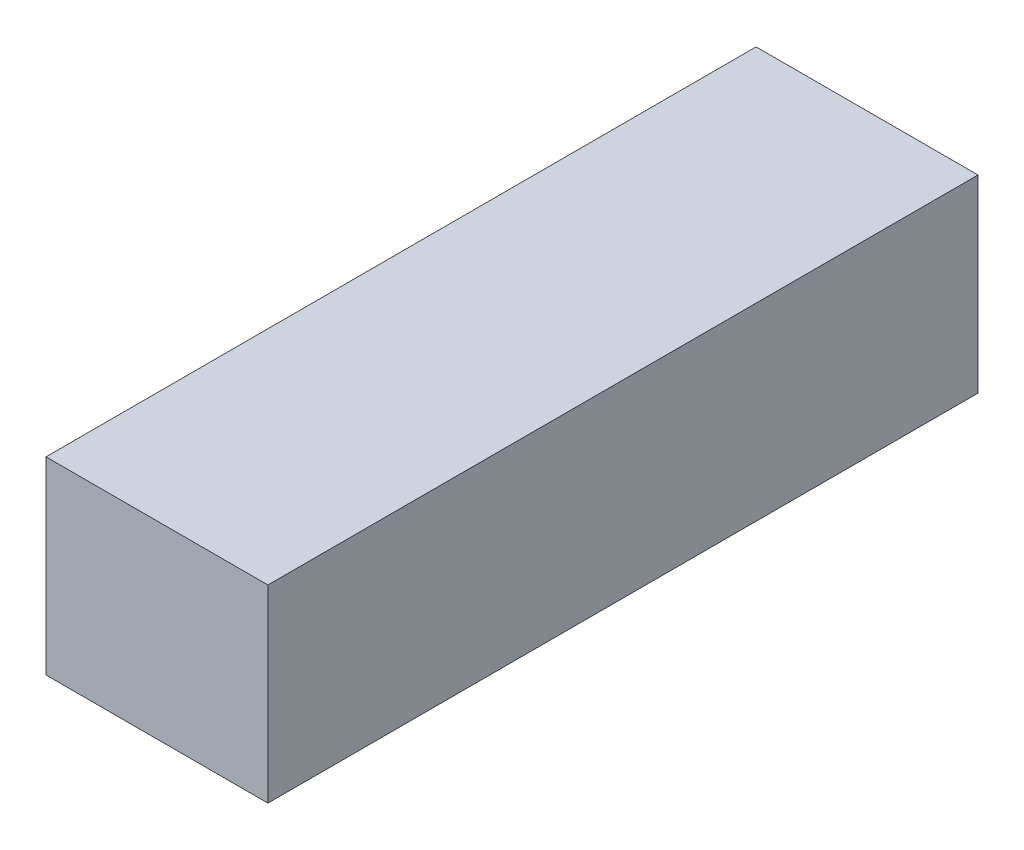
ISO-10303-21;
HEADER;
FILE_DESCRIPTION(('STEP AP214'),'2;1');
FILE_NAME('part.step','',(''),(''),'','','');
FILE_SCHEMA(('AUTOMOTIVE_DESIGN { 1 0 10303 214 1 1 1 1 }'));
ENDSEC;
DATA;
#1=APPLICATION_CONTEXT('core data for automotive mechanical design processes');
#2=APPLICATION_PROTOCOL_DEFINITION('international standard','automotive_design',2000,#1);
#3=PRODUCT_CONTEXT('',#1,'mechanical');
#4=PRODUCT('Part','Part','',(#3));
#5=PRODUCT_RELATED_PRODUCT_CATEGORY('part','',(#4));
#6=PRODUCT_DEFINITION_FORMATION('','',#4);
#7=PRODUCT_DEFINITION_CONTEXT('part definition',#1,'design');
#8=PRODUCT_DEFINITION('design','',#6,#7);
#9=PRODUCT_DEFINITION_SHAPE('','',#8);
#10=(LENGTH_UNIT() NAMED_UNIT(*) SI_UNIT(.MILLI.,.METRE.));
#11=(NAMED_UNIT(*) PLANE_ANGLE_UNIT() SI_UNIT($,.RADIAN.));
#12=(NAMED_UNIT(*) SI_UNIT($,.STERADIAN.) SOLID_ANGLE_UNIT());
#13=UNCERTAINTY_MEASURE_WITH_UNIT(LENGTH_MEASURE(1.E-05),#10,'distance_accuracy_value','');
#14=(GEOMETRIC_REPRESENTATION_CONTEXT(3) GLOBAL_UNCERTAINTY_ASSIGNED_CONTEXT((#13)) GLOBAL_UNIT_ASSIGNED_CONTEXT((#10,
#11,#12)) REPRESENTATION_CONTEXT('',''));
#15=CARTESIAN_POINT('',(0.,0.,0.));
#16=DIRECTION('',(0.,0.,1.));
#17=DIRECTION('',(1.,0.,0.));
#18=AXIS2_PLACEMENT_3D('',#15,#16,#17);
#19=CARTESIAN_POINT('',(17.5,-14.9,112.));
#20=DIRECTION('',(-1.,0.,0.));
#21=DIRECTION('',(0.,0.,1.));
#22=AXIS2_PLACEMENT_3D('',#19,#20,#21);
#23=PLANE('',#22);
#24=DIRECTION('',(0.,1.,0.));
#25=VECTOR('',#24,1.);
#26=CARTESIAN_POINT('',(17.5,-14.9,0.));
#27=LINE('',#26,#25);
#28=CARTESIAN_POINT('',(17.5,-14.9,0.));
#29=VERTEX_POINT('',#28);
#30=CARTESIAN_POINT('',(17.5,14.9,0.));
#31=VERTEX_POINT('',#30);
#32=EDGE_CURVE('E96',#29,#31,#27,.T.);
#33=ORIENTED_EDGE('',*,*,#32,.T.);
#34=DIRECTION('',(0.,0.,-1.));
#35=VECTOR('',#34,1.);
#36=CARTESIAN_POINT('',(17.5,14.9,112.));
#37=LINE('',#36,#35);
#38=CARTESIAN_POINT('',(17.5,14.9,112.));
#39=VERTEX_POINT('',#38);
#40=EDGE_CURVE('E11',#39,#31,#37,.T.);
#41=ORIENTED_EDGE('',*,*,#40,.F.);
#42=DIRECTION('',(0.,1.,0.));
#43=VECTOR('',#42,1.);
#44=CARTESIAN_POINT('',(17.5,-14.9,112.));
#45=LINE('',#44,#43);
#46=CARTESIAN_POINT('',(17.5,-14.9,112.));
#47=VERTEX_POINT('',#46);
#48=EDGE_CURVE('E84',#47,#39,#45,.T.);
#49=ORIENTED_EDGE('',*,*,#48,.F.);
#50=DIRECTION('',(0.,0.,-1.));
#51=VECTOR('',#50,1.);
#52=CARTESIAN_POINT('',(17.5,-14.9,112.));
#53=LINE('',#52,#51);
#54=EDGE_CURVE('E92',#47,#29,#53,.T.);
#55=ORIENTED_EDGE('',*,*,#54,.T.);
#56=EDGE_LOOP('',(#33,#41,#49,#55));
#57=FACE_BOUND('',#56,.T.);
#58=ADVANCED_FACE('F33',(#57),#23,.F.);
#59=CARTESIAN_POINT('',(-17.5,14.9,112.));
#60=DIRECTION('',(0.,-1.,0.));
#61=DIRECTION('',(0.,0.,-1.));
#62=AXIS2_PLACEMENT_3D('',#59,#60,#61);
#63=PLANE('',#62);
#64=DIRECTION('',(-1.,0.,0.));
#65=VECTOR('',#64,1.);
#66=CARTESIAN_POINT('',(-17.5,14.9,0.));
#67=LINE('',#66,#65);
#68=CARTESIAN_POINT('',(-17.5,14.9,0.));
#69=VERTEX_POINT('',#68);
#70=EDGE_CURVE('E88',#31,#69,#67,.T.);
#71=ORIENTED_EDGE('',*,*,#70,.T.);
#72=DIRECTION('',(0.,0.,-1.));
#73=VECTOR('',#72,1.);
#74=CARTESIAN_POINT('',(-17.5,14.9,112.));
#75=LINE('',#74,#73);
#76=CARTESIAN_POINT('',(-17.5,14.9,112.));
#77=VERTEX_POINT('',#76);
#78=EDGE_CURVE('E41',#77,#69,#75,.T.);
#79=ORIENTED_EDGE('',*,*,#78,.F.);
#80=DIRECTION('',(-1.,0.,0.));
#81=VECTOR('',#80,1.);
#82=CARTESIAN_POINT('',(-17.5,14.9,112.));
#83=LINE('',#82,#81);
#84=EDGE_CURVE('E79',#39,#77,#83,.T.);
#85=ORIENTED_EDGE('',*,*,#84,.F.);
#86=ORIENTED_EDGE('',*,*,#40,.T.);
#87=EDGE_LOOP('',(#71,#79,#85,#86));
#88=FACE_BOUND('',#87,.T.);
#89=ADVANCED_FACE('F87',(#88),#63,.F.);
#90=CARTESIAN_POINT('',(-17.5,-14.9,112.));
#91=DIRECTION('',(1.,0.,0.));
#92=DIRECTION('',(0.,0.,-1.));
#93=AXIS2_PLACEMENT_3D('',#90,#91,#92);
#94=PLANE('',#93);
#95=DIRECTION('',(0.,-1.,0.));
#96=VECTOR('',#95,1.);
#97=CARTESIAN_POINT('',(-17.5,-14.9,0.));
#98=LINE('',#97,#96);
#99=CARTESIAN_POINT('',(-17.5,-14.9,0.));
#100=VERTEX_POINT('',#99);
#101=EDGE_CURVE('E66',#69,#100,#98,.T.);
#102=ORIENTED_EDGE('',*,*,#101,.T.);
#103=DIRECTION('',(0.,0.,-1.));
#104=VECTOR('',#103,1.);
#105=CARTESIAN_POINT('',(-17.5,-14.9,112.));
#106=LINE('',#105,#104);
#107=CARTESIAN_POINT('',(-17.5,-14.9,112.));
#108=VERTEX_POINT('',#107);
#109=EDGE_CURVE('E89',#108,#100,#106,.T.);
#110=ORIENTED_EDGE('',*,*,#109,.F.);
#111=DIRECTION('',(0.,-1.,0.));
#112=VECTOR('',#111,1.);
#113=CARTESIAN_POINT('',(-17.5,-14.9,112.));
#114=LINE('',#113,#112);
#115=EDGE_CURVE('E82',#77,#108,#114,.T.);
#116=ORIENTED_EDGE('',*,*,#115,.F.);
#117=ORIENTED_EDGE('',*,*,#78,.T.);
#118=EDGE_LOOP('',(#102,#110,#116,#117));
#119=FACE_BOUND('',#118,.T.);
#120=ADVANCED_FACE('F90',(#119),#94,.F.);
#121=CARTESIAN_POINT('',(-17.5,-14.9,112.));
#122=DIRECTION('',(0.,1.,0.));
#123=DIRECTION('',(0.,0.,1.));
#124=AXIS2_PLACEMENT_3D('',#121,#122,#123);
#125=PLANE('',#124);
#126=DIRECTION('',(1.,0.,0.));
#127=VECTOR('',#126,1.);
#128=CARTESIAN_POINT('',(-17.5,-14.9,0.));
#129=LINE('',#128,#127);
#130=EDGE_CURVE('E72',#100,#29,#129,.T.);
#131=ORIENTED_EDGE('',*,*,#130,.T.);
#132=ORIENTED_EDGE('',*,*,#54,.F.);
#133=DIRECTION('',(1.,0.,0.));
#134=VECTOR('',#133,1.);
#135=CARTESIAN_POINT('',(-17.5,-14.9,112.));
#136=LINE('',#135,#134);
#137=EDGE_CURVE('E49',#108,#47,#136,.T.);
#138=ORIENTED_EDGE('',*,*,#137,.F.);
#139=ORIENTED_EDGE('',*,*,#109,.T.);
#140=EDGE_LOOP('',(#131,#132,#138,#139));
#141=FACE_BOUND('',#140,.T.);
#142=ADVANCED_FACE('F103',(#141),#125,.F.);
#143=CARTESIAN_POINT('',(0.,0.,112.));
#144=DIRECTION('',(0.,0.,-1.));
#145=DIRECTION('',(-1.,0.,0.));
#146=AXIS2_PLACEMENT_3D('',#143,#144,#145);
#147=PLANE('',#146);
#148=ORIENTED_EDGE('',*,*,#48,.T.);
#149=ORIENTED_EDGE('',*,*,#84,.T.);
#150=ORIENTED_EDGE('',*,*,#115,.T.);
#151=ORIENTED_EDGE('',*,*,#137,.T.);
#152=EDGE_LOOP('',(#148,#149,#150,#151));
#153=FACE_BOUND('',#152,.T.);
#154=ADVANCED_FACE('F80',(#153),#147,.F.);
#155=CARTESIAN_POINT('',(0.,0.,0.));
#156=DIRECTION('',(0.,0.,-1.));
#157=DIRECTION('',(-1.,0.,0.));
#158=AXIS2_PLACEMENT_3D('',#155,#156,#157);
#159=PLANE('',#158);
#160=ORIENTED_EDGE('',*,*,#32,.F.);
#161=ORIENTED_EDGE('',*,*,#130,.F.);
#162=ORIENTED_EDGE('',*,*,#101,.F.);
#163=ORIENTED_EDGE('',*,*,#70,.F.);
#164=EDGE_LOOP('',(#160,#161,#162,#163));
#165=FACE_BOUND('',#164,.T.);
#166=ADVANCED_FACE('F106',(#165),#159,.T.);
#167=CLOSED_SHELL('',(#58,#89,#120,#142,#154,#166));
#168=MANIFOLD_SOLID_BREP('B2',#167);
#169=ADVANCED_BREP_SHAPE_REPRESENTATION('',(#18,#168),#14);
#170=SHAPE_DEFINITION_REPRESENTATION(#9,#169);
ENDSEC;
END-ISO-10303-21;
